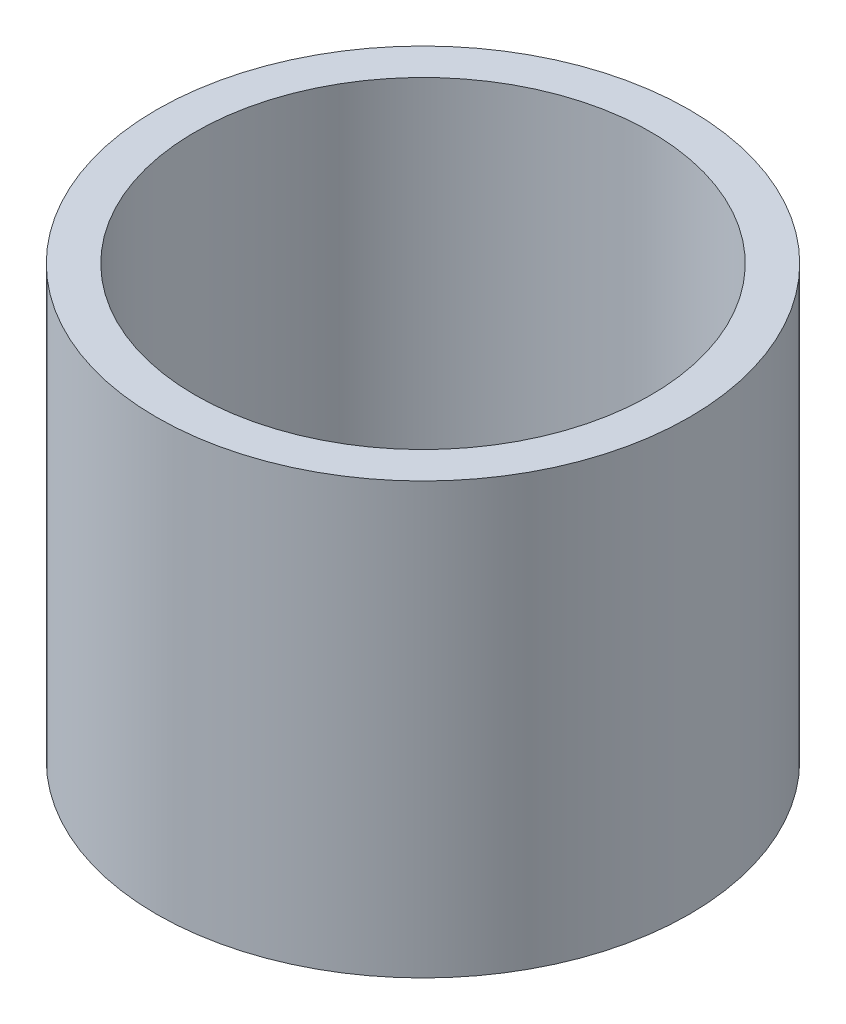
ISO-10303-21;
HEADER;
FILE_DESCRIPTION(('STEP AP214'),'2;1');
FILE_NAME('part.step','',(''),(''),'','','');
FILE_SCHEMA(('AUTOMOTIVE_DESIGN { 1 0 10303 214 1 1 1 1 }'));
ENDSEC;
DATA;
#1=APPLICATION_CONTEXT('core data for automotive mechanical design processes');
#2=APPLICATION_PROTOCOL_DEFINITION('international standard','automotive_design',2000,#1);
#3=PRODUCT_CONTEXT('',#1,'mechanical');
#4=PRODUCT('Part','Part','',(#3));
#5=PRODUCT_RELATED_PRODUCT_CATEGORY('part','',(#4));
#6=PRODUCT_DEFINITION_FORMATION('','',#4);
#7=PRODUCT_DEFINITION_CONTEXT('part definition',#1,'design');
#8=PRODUCT_DEFINITION('design','',#6,#7);
#9=PRODUCT_DEFINITION_SHAPE('','',#8);
#10=(LENGTH_UNIT() NAMED_UNIT(*) SI_UNIT(.MILLI.,.METRE.));
#11=(NAMED_UNIT(*) PLANE_ANGLE_UNIT() SI_UNIT($,.RADIAN.));
#12=(NAMED_UNIT(*) SI_UNIT($,.STERADIAN.) SOLID_ANGLE_UNIT());
#13=UNCERTAINTY_MEASURE_WITH_UNIT(LENGTH_MEASURE(1.E-05),#10,'distance_accuracy_value','');
#14=(GEOMETRIC_REPRESENTATION_CONTEXT(3) GLOBAL_UNCERTAINTY_ASSIGNED_CONTEXT((#13)) GLOBAL_UNIT_ASSIGNED_CONTEXT((#10,
#11,#12)) REPRESENTATION_CONTEXT('',''));
#15=CARTESIAN_POINT('',(0.,0.,0.));
#16=DIRECTION('',(0.,0.,1.));
#17=DIRECTION('',(1.,0.,0.));
#18=AXIS2_PLACEMENT_3D('',#15,#16,#17);
#19=CARTESIAN_POINT('',(0.,40.3894249849058,0.));
#20=DIRECTION('',(0.,-1.,0.));
#21=DIRECTION('',(0.,0.,-1.));
#22=AXIS2_PLACEMENT_3D('',#19,#20,#21);
#23=CYLINDRICAL_SURFACE('',#22,25.);
#24=CARTESIAN_POINT('',(0.,40.3894249849058,0.));
#25=DIRECTION('',(0.,1.,0.));
#26=DIRECTION('',(0.,0.,1.));
#27=AXIS2_PLACEMENT_3D('',#24,#25,#26);
#28=CIRCLE('',#27,25.);
#29=CARTESIAN_POINT('',(0.,40.3894249849058,25.));
#30=VERTEX_POINT('',#29);
#31=EDGE_CURVE('E10',#30,#30,#28,.T.);
#32=ORIENTED_EDGE('',*,*,#31,.F.);
#33=EDGE_LOOP('',(#32));
#34=FACE_BOUND('',#33,.T.);
#35=CARTESIAN_POINT('',(0.,0.,0.));
#36=DIRECTION('',(0.,1.,0.));
#37=DIRECTION('',(0.,0.,1.));
#38=AXIS2_PLACEMENT_3D('',#35,#36,#37);
#39=CIRCLE('',#38,25.);
#40=CARTESIAN_POINT('',(0.,0.,25.));
#41=VERTEX_POINT('',#40);
#42=EDGE_CURVE('E37',#41,#41,#39,.T.);
#43=ORIENTED_EDGE('',*,*,#42,.T.);
#44=EDGE_LOOP('',(#43));
#45=FACE_BOUND('',#44,.T.);
#46=ADVANCED_FACE('F40',(#34,#45),#23,.T.);
#47=CARTESIAN_POINT('',(0.,40.3894249849058,0.));
#48=DIRECTION('',(0.,1.,0.));
#49=DIRECTION('',(0.,0.,1.));
#50=AXIS2_PLACEMENT_3D('',#47,#48,#49);
#51=PLANE('',#50);
#52=CARTESIAN_POINT('',(0.,40.3894249849058,0.));
#53=DIRECTION('',(0.,1.,0.));
#54=DIRECTION('',(0.,0.,1.));
#55=AXIS2_PLACEMENT_3D('',#52,#53,#54);
#56=CIRCLE('',#55,21.3843485461972);
#57=CARTESIAN_POINT('',(0.,40.3894249849058,21.3843485461972));
#58=VERTEX_POINT('',#57);
#59=EDGE_CURVE('E50',#58,#58,#56,.T.);
#60=ORIENTED_EDGE('',*,*,#59,.F.);
#61=EDGE_LOOP('',(#60));
#62=FACE_BOUND('',#61,.T.);
#63=ORIENTED_EDGE('',*,*,#31,.T.);
#64=EDGE_LOOP('',(#63));
#65=FACE_BOUND('',#64,.T.);
#66=ADVANCED_FACE('F59',(#62,#65),#51,.T.);
#67=CARTESIAN_POINT('',(0.,0.,0.));
#68=DIRECTION('',(0.,1.,0.));
#69=DIRECTION('',(0.,0.,1.));
#70=AXIS2_PLACEMENT_3D('',#67,#68,#69);
#71=PLANE('',#70);
#72=CARTESIAN_POINT('',(0.,0.,0.));
#73=DIRECTION('',(0.,1.,0.));
#74=DIRECTION('',(0.,0.,1.));
#75=AXIS2_PLACEMENT_3D('',#72,#73,#74);
#76=CIRCLE('',#75,21.3843485461972);
#77=CARTESIAN_POINT('',(0.,0.,21.3843485461972));
#78=VERTEX_POINT('',#77);
#79=EDGE_CURVE('E47',#78,#78,#76,.T.);
#80=ORIENTED_EDGE('',*,*,#79,.T.);
#81=EDGE_LOOP('',(#80));
#82=FACE_BOUND('',#81,.T.);
#83=ORIENTED_EDGE('',*,*,#42,.F.);
#84=EDGE_LOOP('',(#83));
#85=FACE_BOUND('',#84,.T.);
#86=ADVANCED_FACE('F58',(#82,#85),#71,.F.);
#87=CARTESIAN_POINT('',(0.,40.3894249849058,0.));
#88=DIRECTION('',(0.,-1.,0.));
#89=DIRECTION('',(0.,0.,-1.));
#90=AXIS2_PLACEMENT_3D('',#87,#88,#89);
#91=CYLINDRICAL_SURFACE('',#90,21.3843485461972);
#92=ORIENTED_EDGE('',*,*,#59,.T.);
#93=EDGE_LOOP('',(#92));
#94=FACE_BOUND('',#93,.T.);
#95=ORIENTED_EDGE('',*,*,#79,.F.);
#96=EDGE_LOOP('',(#95));
#97=FACE_BOUND('',#96,.T.);
#98=ADVANCED_FACE('F54',(#94,#97),#91,.F.);
#99=CLOSED_SHELL('',(#46,#66,#86,#98));
#100=MANIFOLD_SOLID_BREP('B2',#99);
#101=ADVANCED_BREP_SHAPE_REPRESENTATION('',(#18,#100),#14);
#102=SHAPE_DEFINITION_REPRESENTATION(#9,#101);
ENDSEC;
END-ISO-10303-21;
